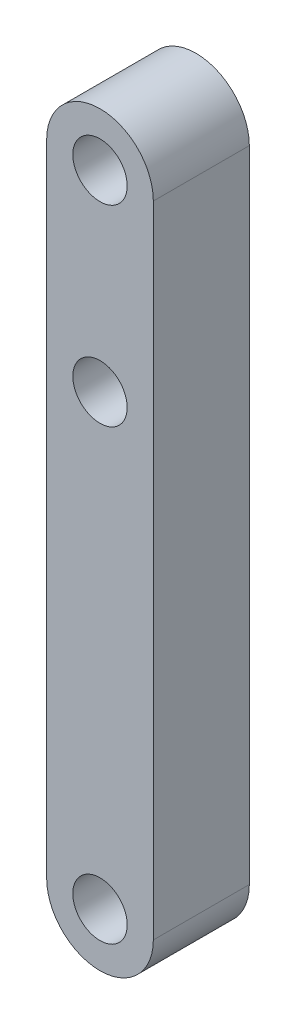
ISO-10303-21;
HEADER;
FILE_DESCRIPTION(('STEP AP214'),'2;1');
FILE_NAME('part.step','',(''),(''),'','','');
FILE_SCHEMA(('AUTOMOTIVE_DESIGN { 1 0 10303 214 1 1 1 1 }'));
ENDSEC;
DATA;
#1=APPLICATION_CONTEXT('core data for automotive mechanical design processes');
#2=APPLICATION_PROTOCOL_DEFINITION('international standard','automotive_design',2000,#1);
#3=PRODUCT_CONTEXT('',#1,'mechanical');
#4=PRODUCT('Part','Part','',(#3));
#5=PRODUCT_RELATED_PRODUCT_CATEGORY('part','',(#4));
#6=PRODUCT_DEFINITION_FORMATION('','',#4);
#7=PRODUCT_DEFINITION_CONTEXT('part definition',#1,'design');
#8=PRODUCT_DEFINITION('design','',#6,#7);
#9=PRODUCT_DEFINITION_SHAPE('','',#8);
#10=(LENGTH_UNIT() NAMED_UNIT(*) SI_UNIT(.MILLI.,.METRE.));
#11=(NAMED_UNIT(*) PLANE_ANGLE_UNIT() SI_UNIT($,.RADIAN.));
#12=(NAMED_UNIT(*) SI_UNIT($,.STERADIAN.) SOLID_ANGLE_UNIT());
#13=UNCERTAINTY_MEASURE_WITH_UNIT(LENGTH_MEASURE(1.E-05),#10,'distance_accuracy_value','');
#14=(GEOMETRIC_REPRESENTATION_CONTEXT(3) GLOBAL_UNCERTAINTY_ASSIGNED_CONTEXT((#13)) GLOBAL_UNIT_ASSIGNED_CONTEXT((#10,
#11,#12)) REPRESENTATION_CONTEXT('',''));
#15=CARTESIAN_POINT('',(0.,0.,0.));
#16=DIRECTION('',(0.,0.,1.));
#17=DIRECTION('',(1.,0.,0.));
#18=AXIS2_PLACEMENT_3D('',#15,#16,#17);
#19=CARTESIAN_POINT('',(0.,0.,9.));
#20=DIRECTION('',(0.,0.,-1.));
#21=DIRECTION('',(-1.,0.,0.));
#22=AXIS2_PLACEMENT_3D('',#19,#20,#21);
#23=CYLINDRICAL_SURFACE('',#22,5.);
#24=CARTESIAN_POINT('',(0.,0.,0.));
#25=DIRECTION('',(0.,0.,1.));
#26=DIRECTION('',(1.,0.,0.));
#27=AXIS2_PLACEMENT_3D('',#24,#25,#26);
#28=CIRCLE('',#27,5.);
#29=CARTESIAN_POINT('',(4.99999999999999,0.,0.));
#30=VERTEX_POINT('',#29);
#31=CARTESIAN_POINT('',(-5.,0.,0.));
#32=VERTEX_POINT('',#31);
#33=EDGE_CURVE('E98',#30,#32,#28,.T.);
#34=ORIENTED_EDGE('',*,*,#33,.T.);
#35=DIRECTION('',(0.,0.,-1.));
#36=VECTOR('',#35,1.);
#37=CARTESIAN_POINT('',(-5.,0.,9.));
#38=LINE('',#37,#36);
#39=CARTESIAN_POINT('',(-5.,0.,9.));
#40=VERTEX_POINT('',#39);
#41=EDGE_CURVE('E11',#40,#32,#38,.T.);
#42=ORIENTED_EDGE('',*,*,#41,.F.);
#43=CARTESIAN_POINT('',(0.,0.,9.));
#44=DIRECTION('',(0.,0.,1.));
#45=DIRECTION('',(1.,0.,0.));
#46=AXIS2_PLACEMENT_3D('',#43,#44,#45);
#47=CIRCLE('',#46,5.);
#48=CARTESIAN_POINT('',(4.99999999999999,0.,9.));
#49=VERTEX_POINT('',#48);
#50=EDGE_CURVE('E86',#49,#40,#47,.T.);
#51=ORIENTED_EDGE('',*,*,#50,.F.);
#52=DIRECTION('',(0.,0.,-1.));
#53=VECTOR('',#52,1.);
#54=CARTESIAN_POINT('',(4.99999999999999,0.,9.));
#55=LINE('',#54,#53);
#56=EDGE_CURVE('E94',#49,#30,#55,.T.);
#57=ORIENTED_EDGE('',*,*,#56,.T.);
#58=EDGE_LOOP('',(#34,#42,#51,#57));
#59=FACE_BOUND('',#58,.T.);
#60=ADVANCED_FACE('F35',(#59),#23,.T.);
#61=CARTESIAN_POINT('',(-5.,0.,9.));
#62=DIRECTION('',(1.,0.,0.));
#63=DIRECTION('',(0.,1.,0.));
#64=AXIS2_PLACEMENT_3D('',#61,#62,#63);
#65=PLANE('',#64);
#66=DIRECTION('',(0.,-1.,0.));
#67=VECTOR('',#66,1.);
#68=CARTESIAN_POINT('',(-5.,0.,0.));
#69=LINE('',#68,#67);
#70=CARTESIAN_POINT('',(-4.99999999999999,-60.,0.));
#71=VERTEX_POINT('',#70);
#72=EDGE_CURVE('E90',#32,#71,#69,.T.);
#73=ORIENTED_EDGE('',*,*,#72,.T.);
#74=DIRECTION('',(0.,0.,-1.));
#75=VECTOR('',#74,1.);
#76=CARTESIAN_POINT('',(-4.99999999999999,-60.,9.));
#77=LINE('',#76,#75);
#78=CARTESIAN_POINT('',(-4.99999999999999,-60.,9.));
#79=VERTEX_POINT('',#78);
#80=EDGE_CURVE('E43',#79,#71,#77,.T.);
#81=ORIENTED_EDGE('',*,*,#80,.F.);
#82=DIRECTION('',(0.,-1.,0.));
#83=VECTOR('',#82,1.);
#84=CARTESIAN_POINT('',(-5.,0.,9.));
#85=LINE('',#84,#83);
#86=EDGE_CURVE('E81',#40,#79,#85,.T.);
#87=ORIENTED_EDGE('',*,*,#86,.F.);
#88=ORIENTED_EDGE('',*,*,#41,.T.);
#89=EDGE_LOOP('',(#73,#81,#87,#88));
#90=FACE_BOUND('',#89,.T.);
#91=ADVANCED_FACE('F89',(#90),#65,.F.);
#92=CARTESIAN_POINT('',(0.,-60.,9.));
#93=DIRECTION('',(0.,0.,-1.));
#94=DIRECTION('',(-1.,0.,0.));
#95=AXIS2_PLACEMENT_3D('',#92,#93,#94);
#96=CYLINDRICAL_SURFACE('',#95,5.);
#97=CARTESIAN_POINT('',(0.,-60.,0.));
#98=DIRECTION('',(0.,0.,1.));
#99=DIRECTION('',(1.,0.,0.));
#100=AXIS2_PLACEMENT_3D('',#97,#98,#99);
#101=CIRCLE('',#100,5.);
#102=CARTESIAN_POINT('',(5.,-60.,0.));
#103=VERTEX_POINT('',#102);
#104=EDGE_CURVE('E68',#71,#103,#101,.T.);
#105=ORIENTED_EDGE('',*,*,#104,.T.);
#106=DIRECTION('',(0.,0.,-1.));
#107=VECTOR('',#106,1.);
#108=CARTESIAN_POINT('',(5.,-60.,9.));
#109=LINE('',#108,#107);
#110=CARTESIAN_POINT('',(5.,-60.,9.));
#111=VERTEX_POINT('',#110);
#112=EDGE_CURVE('E91',#111,#103,#109,.T.);
#113=ORIENTED_EDGE('',*,*,#112,.F.);
#114=CARTESIAN_POINT('',(0.,-60.,9.));
#115=DIRECTION('',(0.,0.,1.));
#116=DIRECTION('',(1.,0.,0.));
#117=AXIS2_PLACEMENT_3D('',#114,#115,#116);
#118=CIRCLE('',#117,5.);
#119=EDGE_CURVE('E84',#79,#111,#118,.T.);
#120=ORIENTED_EDGE('',*,*,#119,.F.);
#121=ORIENTED_EDGE('',*,*,#80,.T.);
#122=EDGE_LOOP('',(#105,#113,#120,#121));
#123=FACE_BOUND('',#122,.T.);
#124=ADVANCED_FACE('F92',(#123),#96,.T.);
#125=CARTESIAN_POINT('',(4.99999999999999,0.,9.));
#126=DIRECTION('',(-1.,0.,0.));
#127=DIRECTION('',(0.,-1.,0.));
#128=AXIS2_PLACEMENT_3D('',#125,#126,#127);
#129=PLANE('',#128);
#130=DIRECTION('',(0.,1.,0.));
#131=VECTOR('',#130,1.);
#132=CARTESIAN_POINT('',(4.99999999999999,0.,0.));
#133=LINE('',#132,#131);
#134=EDGE_CURVE('E74',#103,#30,#133,.T.);
#135=ORIENTED_EDGE('',*,*,#134,.T.);
#136=ORIENTED_EDGE('',*,*,#56,.F.);
#137=DIRECTION('',(0.,1.,0.));
#138=VECTOR('',#137,1.);
#139=CARTESIAN_POINT('',(4.99999999999999,0.,9.));
#140=LINE('',#139,#138);
#141=EDGE_CURVE('E51',#111,#49,#140,.T.);
#142=ORIENTED_EDGE('',*,*,#141,.F.);
#143=ORIENTED_EDGE('',*,*,#112,.T.);
#144=EDGE_LOOP('',(#135,#136,#142,#143));
#145=FACE_BOUND('',#144,.T.);
#146=ADVANCED_FACE('F106',(#145),#129,.F.);
#147=CARTESIAN_POINT('',(0.,0.,9.));
#148=DIRECTION('',(0.,0.,1.));
#149=DIRECTION('',(1.,0.,0.));
#150=AXIS2_PLACEMENT_3D('',#147,#148,#149);
#151=PLANE('',#150);
#152=CARTESIAN_POINT('',(0.,0.,9.));
#153=DIRECTION('',(0.,0.,1.));
#154=DIRECTION('',(1.,0.,0.));
#155=AXIS2_PLACEMENT_3D('',#152,#153,#154);
#156=CIRCLE('',#155,2.55);
#157=CARTESIAN_POINT('',(2.55,0.,9.));
#158=VERTEX_POINT('',#157);
#159=EDGE_CURVE('E124',#158,#158,#156,.T.);
#160=ORIENTED_EDGE('',*,*,#159,.F.);
#161=EDGE_LOOP('',(#160));
#162=FACE_BOUND('',#161,.T.);
#163=CARTESIAN_POINT('',(0.,-60.,9.));
#164=DIRECTION('',(0.,0.,1.));
#165=DIRECTION('',(1.,0.,0.));
#166=AXIS2_PLACEMENT_3D('',#163,#164,#165);
#167=CIRCLE('',#166,2.55);
#168=CARTESIAN_POINT('',(2.55,-60.,9.));
#169=VERTEX_POINT('',#168);
#170=EDGE_CURVE('E118',#169,#169,#167,.T.);
#171=ORIENTED_EDGE('',*,*,#170,.F.);
#172=EDGE_LOOP('',(#171));
#173=FACE_BOUND('',#172,.T.);
#174=CARTESIAN_POINT('',(0.,-18.,9.));
#175=DIRECTION('',(0.,0.,1.));
#176=DIRECTION('',(1.,0.,0.));
#177=AXIS2_PLACEMENT_3D('',#174,#175,#176);
#178=CIRCLE('',#177,2.55);
#179=CARTESIAN_POINT('',(2.55,-18.,9.));
#180=VERTEX_POINT('',#179);
#181=EDGE_CURVE('E112',#180,#180,#178,.T.);
#182=ORIENTED_EDGE('',*,*,#181,.F.);
#183=EDGE_LOOP('',(#182));
#184=FACE_BOUND('',#183,.T.);
#185=ORIENTED_EDGE('',*,*,#50,.T.);
#186=ORIENTED_EDGE('',*,*,#86,.T.);
#187=ORIENTED_EDGE('',*,*,#119,.T.);
#188=ORIENTED_EDGE('',*,*,#141,.T.);
#189=EDGE_LOOP('',(#185,#186,#187,#188));
#190=FACE_BOUND('',#189,.T.);
#191=ADVANCED_FACE('F82',(#162,#173,#184,#190),#151,.T.);
#192=CARTESIAN_POINT('',(0.,0.,0.));
#193=DIRECTION('',(0.,0.,1.));
#194=DIRECTION('',(1.,0.,0.));
#195=AXIS2_PLACEMENT_3D('',#192,#193,#194);
#196=PLANE('',#195);
#197=CARTESIAN_POINT('',(0.,0.,0.));
#198=DIRECTION('',(0.,0.,1.));
#199=DIRECTION('',(1.,0.,0.));
#200=AXIS2_PLACEMENT_3D('',#197,#198,#199);
#201=CIRCLE('',#200,2.55);
#202=CARTESIAN_POINT('',(2.55,0.,0.));
#203=VERTEX_POINT('',#202);
#204=EDGE_CURVE('E101',#203,#203,#201,.T.);
#205=ORIENTED_EDGE('',*,*,#204,.T.);
#206=EDGE_LOOP('',(#205));
#207=FACE_BOUND('',#206,.T.);
#208=CARTESIAN_POINT('',(0.,-60.,0.));
#209=DIRECTION('',(0.,0.,1.));
#210=DIRECTION('',(1.,0.,0.));
#211=AXIS2_PLACEMENT_3D('',#208,#209,#210);
#212=CIRCLE('',#211,2.55);
#213=CARTESIAN_POINT('',(2.55,-60.,0.));
#214=VERTEX_POINT('',#213);
#215=EDGE_CURVE('E121',#214,#214,#212,.T.);
#216=ORIENTED_EDGE('',*,*,#215,.T.);
#217=EDGE_LOOP('',(#216));
#218=FACE_BOUND('',#217,.T.);
#219=CARTESIAN_POINT('',(0.,-18.,0.));
#220=DIRECTION('',(0.,0.,1.));
#221=DIRECTION('',(1.,0.,0.));
#222=AXIS2_PLACEMENT_3D('',#219,#220,#221);
#223=CIRCLE('',#222,2.55);
#224=CARTESIAN_POINT('',(2.55,-18.,0.));
#225=VERTEX_POINT('',#224);
#226=EDGE_CURVE('E115',#225,#225,#223,.T.);
#227=ORIENTED_EDGE('',*,*,#226,.T.);
#228=EDGE_LOOP('',(#227));
#229=FACE_BOUND('',#228,.T.);
#230=ORIENTED_EDGE('',*,*,#33,.F.);
#231=ORIENTED_EDGE('',*,*,#134,.F.);
#232=ORIENTED_EDGE('',*,*,#104,.F.);
#233=ORIENTED_EDGE('',*,*,#72,.F.);
#234=EDGE_LOOP('',(#230,#231,#232,#233));
#235=FACE_BOUND('',#234,.T.);
#236=ADVANCED_FACE('F109',(#207,#218,#229,#235),#196,.F.);
#237=CARTESIAN_POINT('',(0.,-18.,0.));
#238=DIRECTION('',(0.,0.,1.));
#239=DIRECTION('',(1.,0.,0.));
#240=AXIS2_PLACEMENT_3D('',#237,#238,#239);
#241=CYLINDRICAL_SURFACE('',#240,2.55);
#242=ORIENTED_EDGE('',*,*,#226,.F.);
#243=EDGE_LOOP('',(#242));
#244=FACE_BOUND('',#243,.T.);
#245=ORIENTED_EDGE('',*,*,#181,.T.);
#246=EDGE_LOOP('',(#245));
#247=FACE_BOUND('',#246,.T.);
#248=ADVANCED_FACE('F146',(#244,#247),#241,.F.);
#249=CARTESIAN_POINT('',(0.,-60.,0.));
#250=DIRECTION('',(0.,0.,1.));
#251=DIRECTION('',(1.,0.,0.));
#252=AXIS2_PLACEMENT_3D('',#249,#250,#251);
#253=CYLINDRICAL_SURFACE('',#252,2.55);
#254=ORIENTED_EDGE('',*,*,#215,.F.);
#255=EDGE_LOOP('',(#254));
#256=FACE_BOUND('',#255,.T.);
#257=ORIENTED_EDGE('',*,*,#170,.T.);
#258=EDGE_LOOP('',(#257));
#259=FACE_BOUND('',#258,.T.);
#260=ADVANCED_FACE('F135',(#256,#259),#253,.F.);
#261=CARTESIAN_POINT('',(0.,0.,0.));
#262=DIRECTION('',(0.,0.,1.));
#263=DIRECTION('',(1.,0.,0.));
#264=AXIS2_PLACEMENT_3D('',#261,#262,#263);
#265=CYLINDRICAL_SURFACE('',#264,2.55);
#266=ORIENTED_EDGE('',*,*,#204,.F.);
#267=EDGE_LOOP('',(#266));
#268=FACE_BOUND('',#267,.T.);
#269=ORIENTED_EDGE('',*,*,#159,.T.);
#270=EDGE_LOOP('',(#269));
#271=FACE_BOUND('',#270,.T.);
#272=ADVANCED_FACE('F132',(#268,#271),#265,.F.);
#273=CLOSED_SHELL('',(#60,#91,#124,#146,#191,#236,#248,#260,#272));
#274=MANIFOLD_SOLID_BREP('B2',#273);
#275=ADVANCED_BREP_SHAPE_REPRESENTATION('',(#18,#274),#14);
#276=SHAPE_DEFINITION_REPRESENTATION(#9,#275);
ENDSEC;
END-ISO-10303-21;
